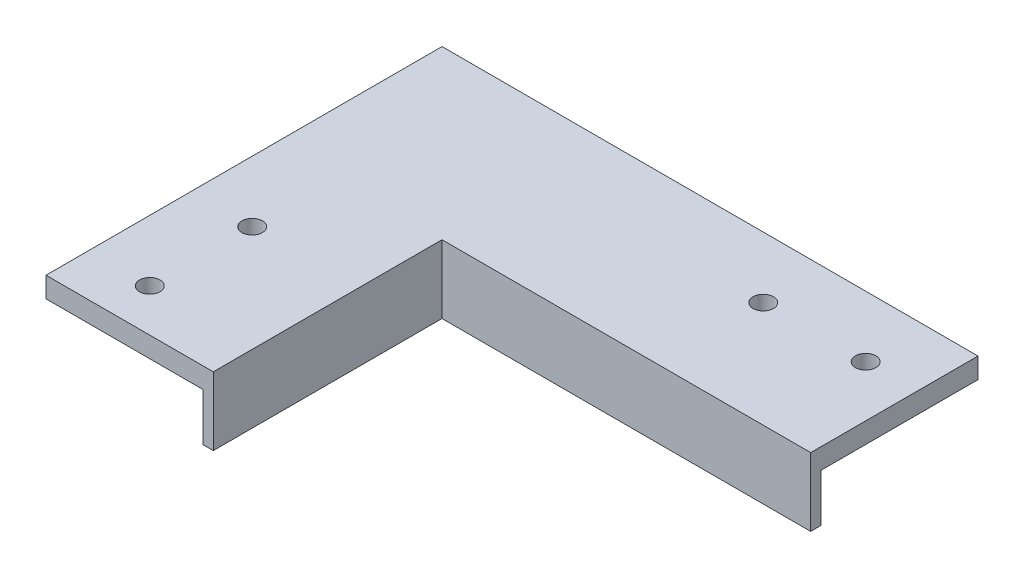
ISO-10303-21;
HEADER;
FILE_DESCRIPTION(('STEP AP214'),'2;1');
FILE_NAME('part.step','',(''),(''),'','','');
FILE_SCHEMA(('AUTOMOTIVE_DESIGN { 1 0 10303 214 1 1 1 1 }'));
ENDSEC;
DATA;
#1=APPLICATION_CONTEXT('core data for automotive mechanical design processes');
#2=APPLICATION_PROTOCOL_DEFINITION('international standard','automotive_design',2000,#1);
#3=PRODUCT_CONTEXT('',#1,'mechanical');
#4=PRODUCT('Part','Part','',(#3));
#5=PRODUCT_RELATED_PRODUCT_CATEGORY('part','',(#4));
#6=PRODUCT_DEFINITION_FORMATION('','',#4);
#7=PRODUCT_DEFINITION_CONTEXT('part definition',#1,'design');
#8=PRODUCT_DEFINITION('design','',#6,#7);
#9=PRODUCT_DEFINITION_SHAPE('','',#8);
#10=(LENGTH_UNIT() NAMED_UNIT(*) SI_UNIT(.MILLI.,.METRE.));
#11=(NAMED_UNIT(*) PLANE_ANGLE_UNIT() SI_UNIT($,.RADIAN.));
#12=(NAMED_UNIT(*) SI_UNIT($,.STERADIAN.) SOLID_ANGLE_UNIT());
#13=UNCERTAINTY_MEASURE_WITH_UNIT(LENGTH_MEASURE(1.E-05),#10,'distance_accuracy_value','');
#14=(GEOMETRIC_REPRESENTATION_CONTEXT(3) GLOBAL_UNCERTAINTY_ASSIGNED_CONTEXT((#13)) GLOBAL_UNIT_ASSIGNED_CONTEXT((#10,
#11,#12)) REPRESENTATION_CONTEXT('',''));
#15=CARTESIAN_POINT('',(0.,0.,0.));
#16=DIRECTION('',(0.,0.,1.));
#17=DIRECTION('',(1.,0.,0.));
#18=AXIS2_PLACEMENT_3D('',#15,#16,#17);
#19=CARTESIAN_POINT('',(-39.25,3.,-29.));
#20=DIRECTION('',(0.,0.,1.));
#21=DIRECTION('',(-1.,0.,0.));
#22=AXIS2_PLACEMENT_3D('',#19,#20,#21);
#23=PLANE('',#22);
#24=DIRECTION('',(1.,0.,0.));
#25=VECTOR('',#24,1.);
#26=CARTESIAN_POINT('',(-39.25,0.,-29.));
#27=LINE('',#26,#25);
#28=CARTESIAN_POINT('',(-39.25,0.,-29.));
#29=VERTEX_POINT('',#28);
#30=CARTESIAN_POINT('',(39.25,0.,-29.));
#31=VERTEX_POINT('',#30);
#32=EDGE_CURVE('E165',#29,#31,#27,.T.);
#33=ORIENTED_EDGE('',*,*,#32,.F.);
#34=DIRECTION('',(0.,-1.,0.));
#35=VECTOR('',#34,1.);
#36=CARTESIAN_POINT('',(-39.25,3.,-29.));
#37=LINE('',#36,#35);
#38=CARTESIAN_POINT('',(-39.25,3.,-29.));
#39=VERTEX_POINT('',#38);
#40=EDGE_CURVE('E176',#39,#29,#37,.T.);
#41=ORIENTED_EDGE('',*,*,#40,.F.);
#42=DIRECTION('',(1.,0.,0.));
#43=VECTOR('',#42,1.);
#44=CARTESIAN_POINT('',(-39.25,3.,-29.));
#45=LINE('',#44,#43);
#46=CARTESIAN_POINT('',(39.25,3.,-29.));
#47=VERTEX_POINT('',#46);
#48=EDGE_CURVE('E168',#39,#47,#45,.T.);
#49=ORIENTED_EDGE('',*,*,#48,.T.);
#50=DIRECTION('',(0.,-1.,0.));
#51=VECTOR('',#50,1.);
#52=CARTESIAN_POINT('',(39.25,3.,-29.));
#53=LINE('',#52,#51);
#54=EDGE_CURVE('E11',#47,#31,#53,.T.);
#55=ORIENTED_EDGE('',*,*,#54,.T.);
#56=EDGE_LOOP('',(#33,#41,#49,#55));
#57=FACE_BOUND('',#56,.T.);
#58=ADVANCED_FACE('F35',(#57),#23,.F.);
#59=CARTESIAN_POINT('',(39.25,3.,-29.));
#60=DIRECTION('',(-1.,0.,0.));
#61=DIRECTION('',(0.,0.,-1.));
#62=AXIS2_PLACEMENT_3D('',#59,#60,#61);
#63=PLANE('',#62);
#64=DIRECTION('',(0.,0.,1.));
#65=VECTOR('',#64,1.);
#66=CARTESIAN_POINT('',(39.25,0.,-29.));
#67=LINE('',#66,#65);
#68=CARTESIAN_POINT('',(39.25,0.,-6.));
#69=VERTEX_POINT('',#68);
#70=EDGE_CURVE('E178',#31,#69,#67,.T.);
#71=ORIENTED_EDGE('',*,*,#70,.F.);
#72=ORIENTED_EDGE('',*,*,#54,.F.);
#73=DIRECTION('',(0.,0.,1.));
#74=VECTOR('',#73,1.);
#75=CARTESIAN_POINT('',(39.25,3.,-29.));
#76=LINE('',#75,#74);
#77=CARTESIAN_POINT('',(39.25,3.,-4.5));
#78=VERTEX_POINT('',#77);
#79=EDGE_CURVE('E78',#47,#78,#76,.T.);
#80=ORIENTED_EDGE('',*,*,#79,.T.);
#81=DIRECTION('',(0.,1.,0.));
#82=VECTOR('',#81,1.);
#83=CARTESIAN_POINT('',(39.25,-7.,-4.5));
#84=LINE('',#83,#82);
#85=CARTESIAN_POINT('',(39.25,-7.,-4.5));
#86=VERTEX_POINT('',#85);
#87=EDGE_CURVE('E200',#86,#78,#84,.T.);
#88=ORIENTED_EDGE('',*,*,#87,.F.);
#89=DIRECTION('',(0.,0.,1.));
#90=VECTOR('',#89,1.);
#91=CARTESIAN_POINT('',(39.25,-7.,-6.));
#92=LINE('',#91,#90);
#93=CARTESIAN_POINT('',(39.25,-7.,-6.));
#94=VERTEX_POINT('',#93);
#95=EDGE_CURVE('E199',#94,#86,#92,.T.);
#96=ORIENTED_EDGE('',*,*,#95,.F.);
#97=DIRECTION('',(0.,1.,0.));
#98=VECTOR('',#97,1.);
#99=CARTESIAN_POINT('',(39.25,-7.,-6.));
#100=LINE('',#99,#98);
#101=EDGE_CURVE('E136',#94,#69,#100,.T.);
#102=ORIENTED_EDGE('',*,*,#101,.T.);
#103=EDGE_LOOP('',(#71,#72,#80,#88,#96,#102));
#104=FACE_BOUND('',#103,.T.);
#105=ADVANCED_FACE('F196',(#104),#63,.F.);
#106=CARTESIAN_POINT('',(-16.25,3.,29.));
#107=DIRECTION('',(0.,0.,-1.));
#108=DIRECTION('',(1.,0.,0.));
#109=AXIS2_PLACEMENT_3D('',#106,#107,#108);
#110=PLANE('',#109);
#111=DIRECTION('',(-1.,0.,0.));
#112=VECTOR('',#111,1.);
#113=CARTESIAN_POINT('',(-16.25,0.,29.));
#114=LINE('',#113,#112);
#115=CARTESIAN_POINT('',(-16.25,0.,29.));
#116=VERTEX_POINT('',#115);
#117=CARTESIAN_POINT('',(-39.25,0.,29.));
#118=VERTEX_POINT('',#117);
#119=EDGE_CURVE('E134',#116,#118,#114,.T.);
#120=ORIENTED_EDGE('',*,*,#119,.F.);
#121=DIRECTION('',(0.,1.,0.));
#122=VECTOR('',#121,1.);
#123=CARTESIAN_POINT('',(-16.25,-7.,29.));
#124=LINE('',#123,#122);
#125=CARTESIAN_POINT('',(-16.25,-7.,29.));
#126=VERTEX_POINT('',#125);
#127=EDGE_CURVE('E116',#126,#116,#124,.T.);
#128=ORIENTED_EDGE('',*,*,#127,.F.);
#129=DIRECTION('',(-1.,0.,0.));
#130=VECTOR('',#129,1.);
#131=CARTESIAN_POINT('',(-14.75,-7.,29.));
#132=LINE('',#131,#130);
#133=CARTESIAN_POINT('',(-14.75,-7.,29.));
#134=VERTEX_POINT('',#133);
#135=EDGE_CURVE('E122',#134,#126,#132,.T.);
#136=ORIENTED_EDGE('',*,*,#135,.F.);
#137=DIRECTION('',(0.,1.,0.));
#138=VECTOR('',#137,1.);
#139=CARTESIAN_POINT('',(-14.75,-7.,29.));
#140=LINE('',#139,#138);
#141=CARTESIAN_POINT('',(-14.75,3.,29.));
#142=VERTEX_POINT('',#141);
#143=EDGE_CURVE('E149',#134,#142,#140,.T.);
#144=ORIENTED_EDGE('',*,*,#143,.T.);
#145=DIRECTION('',(-1.,0.,0.));
#146=VECTOR('',#145,1.);
#147=CARTESIAN_POINT('',(-16.25,3.,29.));
#148=LINE('',#147,#146);
#149=CARTESIAN_POINT('',(-39.25,3.,29.));
#150=VERTEX_POINT('',#149);
#151=EDGE_CURVE('E172',#142,#150,#148,.T.);
#152=ORIENTED_EDGE('',*,*,#151,.T.);
#153=DIRECTION('',(0.,-1.,0.));
#154=VECTOR('',#153,1.);
#155=CARTESIAN_POINT('',(-39.25,3.,29.));
#156=LINE('',#155,#154);
#157=EDGE_CURVE('E43',#150,#118,#156,.T.);
#158=ORIENTED_EDGE('',*,*,#157,.T.);
#159=EDGE_LOOP('',(#120,#128,#136,#144,#152,#158));
#160=FACE_BOUND('',#159,.T.);
#161=ADVANCED_FACE('F133',(#160),#110,.F.);
#162=CARTESIAN_POINT('',(-39.25,3.,29.));
#163=DIRECTION('',(1.,0.,0.));
#164=DIRECTION('',(0.,0.,1.));
#165=AXIS2_PLACEMENT_3D('',#162,#163,#164);
#166=PLANE('',#165);
#167=DIRECTION('',(0.,0.,-1.));
#168=VECTOR('',#167,1.);
#169=CARTESIAN_POINT('',(-39.25,0.,29.));
#170=LINE('',#169,#168);
#171=EDGE_CURVE('E69',#118,#29,#170,.T.);
#172=ORIENTED_EDGE('',*,*,#171,.F.);
#173=ORIENTED_EDGE('',*,*,#157,.F.);
#174=DIRECTION('',(0.,0.,-1.));
#175=VECTOR('',#174,1.);
#176=CARTESIAN_POINT('',(-39.25,3.,29.));
#177=LINE('',#176,#175);
#178=EDGE_CURVE('E51',#150,#39,#177,.T.);
#179=ORIENTED_EDGE('',*,*,#178,.T.);
#180=ORIENTED_EDGE('',*,*,#40,.T.);
#181=EDGE_LOOP('',(#172,#173,#179,#180));
#182=FACE_BOUND('',#181,.T.);
#183=ADVANCED_FACE('F223',(#182),#166,.F.);
#184=CARTESIAN_POINT('',(0.,3.,0.));
#185=DIRECTION('',(0.,1.,0.));
#186=DIRECTION('',(0.,0.,-1.));
#187=AXIS2_PLACEMENT_3D('',#184,#185,#186);
#188=PLANE('',#187);
#189=CARTESIAN_POINT('',(-30.3,3.,7.75));
#190=DIRECTION('',(0.,-1.,0.));
#191=DIRECTION('',(0.,0.,-1.));
#192=AXIS2_PLACEMENT_3D('',#189,#190,#191);
#193=CIRCLE('',#192,1.5);
#194=CARTESIAN_POINT('',(-30.3,3.,6.25));
#195=VERTEX_POINT('',#194);
#196=EDGE_CURVE('E146',#195,#195,#193,.T.);
#197=ORIENTED_EDGE('',*,*,#196,.T.);
#198=EDGE_LOOP('',(#197));
#199=FACE_BOUND('',#198,.T.);
#200=CARTESIAN_POINT('',(-30.3,3.,22.75));
#201=DIRECTION('',(0.,-1.,0.));
#202=DIRECTION('',(0.,0.,-1.));
#203=AXIS2_PLACEMENT_3D('',#200,#201,#202);
#204=CIRCLE('',#203,1.5);
#205=CARTESIAN_POINT('',(-30.3,3.,21.25));
#206=VERTEX_POINT('',#205);
#207=EDGE_CURVE('E145',#206,#206,#204,.T.);
#208=ORIENTED_EDGE('',*,*,#207,.T.);
#209=EDGE_LOOP('',(#208));
#210=FACE_BOUND('',#209,.T.);
#211=CARTESIAN_POINT('',(16.75,3.,-20.05));
#212=DIRECTION('',(0.,-1.,0.));
#213=DIRECTION('',(0.,0.,-1.));
#214=AXIS2_PLACEMENT_3D('',#211,#212,#213);
#215=CIRCLE('',#214,1.5);
#216=CARTESIAN_POINT('',(16.75,3.,-21.55));
#217=VERTEX_POINT('',#216);
#218=EDGE_CURVE('E153',#217,#217,#215,.T.);
#219=ORIENTED_EDGE('',*,*,#218,.T.);
#220=EDGE_LOOP('',(#219));
#221=FACE_BOUND('',#220,.T.);
#222=CARTESIAN_POINT('',(31.75,3.,-20.05));
#223=DIRECTION('',(0.,-1.,0.));
#224=DIRECTION('',(0.,0.,-1.));
#225=AXIS2_PLACEMENT_3D('',#222,#223,#224);
#226=CIRCLE('',#225,1.5);
#227=CARTESIAN_POINT('',(31.75,3.,-21.55));
#228=VERTEX_POINT('',#227);
#229=EDGE_CURVE('E159',#228,#228,#226,.T.);
#230=ORIENTED_EDGE('',*,*,#229,.T.);
#231=EDGE_LOOP('',(#230));
#232=FACE_BOUND('',#231,.T.);
#233=ORIENTED_EDGE('',*,*,#48,.F.);
#234=ORIENTED_EDGE('',*,*,#178,.F.);
#235=ORIENTED_EDGE('',*,*,#151,.F.);
#236=DIRECTION('',(0.,0.,1.));
#237=VECTOR('',#236,1.);
#238=CARTESIAN_POINT('',(-14.75,3.,-4.50000000000001));
#239=LINE('',#238,#237);
#240=CARTESIAN_POINT('',(-14.75,3.,-4.50000000000001));
#241=VERTEX_POINT('',#240);
#242=EDGE_CURVE('E131',#241,#142,#239,.T.);
#243=ORIENTED_EDGE('',*,*,#242,.F.);
#244=DIRECTION('',(-1.,0.,0.));
#245=VECTOR('',#244,1.);
#246=CARTESIAN_POINT('',(39.25,3.,-4.5));
#247=LINE('',#246,#245);
#248=EDGE_CURVE('E208',#78,#241,#247,.T.);
#249=ORIENTED_EDGE('',*,*,#248,.F.);
#250=ORIENTED_EDGE('',*,*,#79,.F.);
#251=EDGE_LOOP('',(#233,#234,#235,#243,#249,#250));
#252=FACE_BOUND('',#251,.T.);
#253=ADVANCED_FACE('F219',(#199,#210,#221,#232,#252),#188,.T.);
#254=CARTESIAN_POINT('',(0.,0.,0.));
#255=DIRECTION('',(0.,1.,0.));
#256=DIRECTION('',(0.,0.,-1.));
#257=AXIS2_PLACEMENT_3D('',#254,#255,#256);
#258=PLANE('',#257);
#259=CARTESIAN_POINT('',(-30.3,0.,7.75));
#260=DIRECTION('',(0.,-1.,0.));
#261=DIRECTION('',(0.,0.,-1.));
#262=AXIS2_PLACEMENT_3D('',#259,#260,#261);
#263=CIRCLE('',#262,1.5);
#264=CARTESIAN_POINT('',(-30.3,0.,6.25));
#265=VERTEX_POINT('',#264);
#266=EDGE_CURVE('E142',#265,#265,#263,.T.);
#267=ORIENTED_EDGE('',*,*,#266,.F.);
#268=EDGE_LOOP('',(#267));
#269=FACE_BOUND('',#268,.T.);
#270=CARTESIAN_POINT('',(-30.3,0.,22.75));
#271=DIRECTION('',(0.,-1.,0.));
#272=DIRECTION('',(0.,0.,-1.));
#273=AXIS2_PLACEMENT_3D('',#270,#271,#272);
#274=CIRCLE('',#273,1.5);
#275=CARTESIAN_POINT('',(-30.3,0.,21.25));
#276=VERTEX_POINT('',#275);
#277=EDGE_CURVE('E150',#276,#276,#274,.T.);
#278=ORIENTED_EDGE('',*,*,#277,.F.);
#279=EDGE_LOOP('',(#278));
#280=FACE_BOUND('',#279,.T.);
#281=CARTESIAN_POINT('',(16.75,0.,-20.05));
#282=DIRECTION('',(0.,-1.,0.));
#283=DIRECTION('',(0.,0.,-1.));
#284=AXIS2_PLACEMENT_3D('',#281,#282,#283);
#285=CIRCLE('',#284,1.5);
#286=CARTESIAN_POINT('',(16.75,0.,-21.55));
#287=VERTEX_POINT('',#286);
#288=EDGE_CURVE('E156',#287,#287,#285,.T.);
#289=ORIENTED_EDGE('',*,*,#288,.F.);
#290=EDGE_LOOP('',(#289));
#291=FACE_BOUND('',#290,.T.);
#292=CARTESIAN_POINT('',(31.75,0.,-20.05));
#293=DIRECTION('',(0.,-1.,0.));
#294=DIRECTION('',(0.,0.,-1.));
#295=AXIS2_PLACEMENT_3D('',#292,#293,#294);
#296=CIRCLE('',#295,1.5);
#297=CARTESIAN_POINT('',(31.75,0.,-21.55));
#298=VERTEX_POINT('',#297);
#299=EDGE_CURVE('E162',#298,#298,#296,.T.);
#300=ORIENTED_EDGE('',*,*,#299,.F.);
#301=EDGE_LOOP('',(#300));
#302=FACE_BOUND('',#301,.T.);
#303=ORIENTED_EDGE('',*,*,#32,.T.);
#304=ORIENTED_EDGE('',*,*,#70,.T.);
#305=DIRECTION('',(-1.,0.,0.));
#306=VECTOR('',#305,1.);
#307=CARTESIAN_POINT('',(-16.25,0.,-6.));
#308=LINE('',#307,#306);
#309=CARTESIAN_POINT('',(-16.25,0.,-6.));
#310=VERTEX_POINT('',#309);
#311=EDGE_CURVE('E181',#69,#310,#308,.T.);
#312=ORIENTED_EDGE('',*,*,#311,.T.);
#313=DIRECTION('',(0.,0.,1.));
#314=VECTOR('',#313,1.);
#315=CARTESIAN_POINT('',(-16.25,0.,29.));
#316=LINE('',#315,#314);
#317=EDGE_CURVE('E184',#310,#116,#316,.T.);
#318=ORIENTED_EDGE('',*,*,#317,.T.);
#319=ORIENTED_EDGE('',*,*,#119,.T.);
#320=ORIENTED_EDGE('',*,*,#171,.T.);
#321=EDGE_LOOP('',(#303,#304,#312,#318,#319,#320));
#322=FACE_BOUND('',#321,.T.);
#323=ADVANCED_FACE('F189',(#269,#280,#291,#302,#322),#258,.F.);
#324=CARTESIAN_POINT('',(31.75,0.,-20.05));
#325=DIRECTION('',(0.,1.,0.));
#326=DIRECTION('',(0.,0.,-1.));
#327=AXIS2_PLACEMENT_3D('',#324,#325,#326);
#328=CYLINDRICAL_SURFACE('',#327,1.5);
#329=ORIENTED_EDGE('',*,*,#299,.T.);
#330=EDGE_LOOP('',(#329));
#331=FACE_BOUND('',#330,.T.);
#332=ORIENTED_EDGE('',*,*,#229,.F.);
#333=EDGE_LOOP('',(#332));
#334=FACE_BOUND('',#333,.T.);
#335=ADVANCED_FACE('F265',(#331,#334),#328,.F.);
#336=CARTESIAN_POINT('',(16.75,0.,-20.05));
#337=DIRECTION('',(0.,1.,0.));
#338=DIRECTION('',(0.,0.,-1.));
#339=AXIS2_PLACEMENT_3D('',#336,#337,#338);
#340=CYLINDRICAL_SURFACE('',#339,1.5);
#341=ORIENTED_EDGE('',*,*,#288,.T.);
#342=EDGE_LOOP('',(#341));
#343=FACE_BOUND('',#342,.T.);
#344=ORIENTED_EDGE('',*,*,#218,.F.);
#345=EDGE_LOOP('',(#344));
#346=FACE_BOUND('',#345,.T.);
#347=ADVANCED_FACE('F274',(#343,#346),#340,.F.);
#348=CARTESIAN_POINT('',(-30.3,0.,22.75));
#349=DIRECTION('',(0.,1.,0.));
#350=DIRECTION('',(0.,0.,-1.));
#351=AXIS2_PLACEMENT_3D('',#348,#349,#350);
#352=CYLINDRICAL_SURFACE('',#351,1.5);
#353=ORIENTED_EDGE('',*,*,#277,.T.);
#354=EDGE_LOOP('',(#353));
#355=FACE_BOUND('',#354,.T.);
#356=ORIENTED_EDGE('',*,*,#207,.F.);
#357=EDGE_LOOP('',(#356));
#358=FACE_BOUND('',#357,.T.);
#359=ADVANCED_FACE('F284',(#355,#358),#352,.F.);
#360=CARTESIAN_POINT('',(-30.3,0.,7.75));
#361=DIRECTION('',(0.,1.,0.));
#362=DIRECTION('',(0.,0.,-1.));
#363=AXIS2_PLACEMENT_3D('',#360,#361,#362);
#364=CYLINDRICAL_SURFACE('',#363,1.5);
#365=ORIENTED_EDGE('',*,*,#266,.T.);
#366=EDGE_LOOP('',(#365));
#367=FACE_BOUND('',#366,.T.);
#368=ORIENTED_EDGE('',*,*,#196,.F.);
#369=EDGE_LOOP('',(#368));
#370=FACE_BOUND('',#369,.T.);
#371=ADVANCED_FACE('F294',(#367,#370),#364,.F.);
#372=CARTESIAN_POINT('',(-16.25,-7.,-6.));
#373=DIRECTION('',(0.,0.,-1.));
#374=DIRECTION('',(1.,0.,0.));
#375=AXIS2_PLACEMENT_3D('',#372,#373,#374);
#376=PLANE('',#375);
#377=ORIENTED_EDGE('',*,*,#311,.F.);
#378=ORIENTED_EDGE('',*,*,#101,.F.);
#379=DIRECTION('',(1.,0.,0.));
#380=VECTOR('',#379,1.);
#381=CARTESIAN_POINT('',(-16.25,-7.,-6.));
#382=LINE('',#381,#380);
#383=CARTESIAN_POINT('',(-16.25,-7.,-6.));
#384=VERTEX_POINT('',#383);
#385=EDGE_CURVE('E121',#384,#94,#382,.T.);
#386=ORIENTED_EDGE('',*,*,#385,.F.);
#387=DIRECTION('',(0.,1.,0.));
#388=VECTOR('',#387,1.);
#389=CARTESIAN_POINT('',(-16.25,-7.,-6.));
#390=LINE('',#389,#388);
#391=EDGE_CURVE('E118',#384,#310,#390,.T.);
#392=ORIENTED_EDGE('',*,*,#391,.T.);
#393=EDGE_LOOP('',(#377,#378,#386,#392));
#394=FACE_BOUND('',#393,.T.);
#395=ADVANCED_FACE('F193',(#394),#376,.T.);
#396=CARTESIAN_POINT('',(-16.25,-7.,29.));
#397=DIRECTION('',(-1.,0.,0.));
#398=DIRECTION('',(0.,0.,-1.));
#399=AXIS2_PLACEMENT_3D('',#396,#397,#398);
#400=PLANE('',#399);
#401=ORIENTED_EDGE('',*,*,#317,.F.);
#402=ORIENTED_EDGE('',*,*,#391,.F.);
#403=DIRECTION('',(0.,0.,-1.));
#404=VECTOR('',#403,1.);
#405=CARTESIAN_POINT('',(-16.25,-7.,29.));
#406=LINE('',#405,#404);
#407=EDGE_CURVE('E111',#126,#384,#406,.T.);
#408=ORIENTED_EDGE('',*,*,#407,.F.);
#409=ORIENTED_EDGE('',*,*,#127,.T.);
#410=EDGE_LOOP('',(#401,#402,#408,#409));
#411=FACE_BOUND('',#410,.T.);
#412=ADVANCED_FACE('F114',(#411),#400,.T.);
#413=CARTESIAN_POINT('',(-14.75,-7.,-4.50000000000001));
#414=DIRECTION('',(1.,0.,0.));
#415=DIRECTION('',(0.,0.,1.));
#416=AXIS2_PLACEMENT_3D('',#413,#414,#415);
#417=PLANE('',#416);
#418=ORIENTED_EDGE('',*,*,#242,.T.);
#419=ORIENTED_EDGE('',*,*,#143,.F.);
#420=DIRECTION('',(0.,0.,1.));
#421=VECTOR('',#420,1.);
#422=CARTESIAN_POINT('',(-14.75,-7.,-4.50000000000001));
#423=LINE('',#422,#421);
#424=CARTESIAN_POINT('',(-14.75,-7.,-4.50000000000001));
#425=VERTEX_POINT('',#424);
#426=EDGE_CURVE('E127',#425,#134,#423,.T.);
#427=ORIENTED_EDGE('',*,*,#426,.F.);
#428=DIRECTION('',(0.,1.,0.));
#429=VECTOR('',#428,1.);
#430=CARTESIAN_POINT('',(-14.75,-7.,-4.50000000000001));
#431=LINE('',#430,#429);
#432=EDGE_CURVE('E202',#425,#241,#431,.T.);
#433=ORIENTED_EDGE('',*,*,#432,.T.);
#434=EDGE_LOOP('',(#418,#419,#427,#433));
#435=FACE_BOUND('',#434,.T.);
#436=ADVANCED_FACE('F218',(#435),#417,.T.);
#437=CARTESIAN_POINT('',(39.25,-7.,-4.5));
#438=DIRECTION('',(0.,0.,1.));
#439=DIRECTION('',(-1.,0.,0.));
#440=AXIS2_PLACEMENT_3D('',#437,#438,#439);
#441=PLANE('',#440);
#442=ORIENTED_EDGE('',*,*,#248,.T.);
#443=ORIENTED_EDGE('',*,*,#432,.F.);
#444=DIRECTION('',(-1.,0.,0.));
#445=VECTOR('',#444,1.);
#446=CARTESIAN_POINT('',(39.25,-7.,-4.5));
#447=LINE('',#446,#445);
#448=EDGE_CURVE('E138',#86,#425,#447,.T.);
#449=ORIENTED_EDGE('',*,*,#448,.F.);
#450=ORIENTED_EDGE('',*,*,#87,.T.);
#451=EDGE_LOOP('',(#442,#443,#449,#450));
#452=FACE_BOUND('',#451,.T.);
#453=ADVANCED_FACE('F215',(#452),#441,.T.);
#454=CARTESIAN_POINT('',(0.,-7.,0.));
#455=DIRECTION('',(0.,1.,0.));
#456=DIRECTION('',(0.,0.,-1.));
#457=AXIS2_PLACEMENT_3D('',#454,#455,#456);
#458=PLANE('',#457);
#459=ORIENTED_EDGE('',*,*,#135,.T.);
#460=ORIENTED_EDGE('',*,*,#407,.T.);
#461=ORIENTED_EDGE('',*,*,#385,.T.);
#462=ORIENTED_EDGE('',*,*,#95,.T.);
#463=ORIENTED_EDGE('',*,*,#448,.T.);
#464=ORIENTED_EDGE('',*,*,#426,.T.);
#465=EDGE_LOOP('',(#459,#460,#461,#462,#463,#464));
#466=FACE_BOUND('',#465,.T.);
#467=ADVANCED_FACE('F125',(#466),#458,.F.);
#468=CLOSED_SHELL('',(#58,#105,#161,#183,#253,#323,#335,#347,#359,#371,#395,#412,#436,#453,#467));
#469=MANIFOLD_SOLID_BREP('B2',#468);
#470=ADVANCED_BREP_SHAPE_REPRESENTATION('',(#18,#469),#14);
#471=SHAPE_DEFINITION_REPRESENTATION(#9,#470);
ENDSEC;
END-ISO-10303-21;
